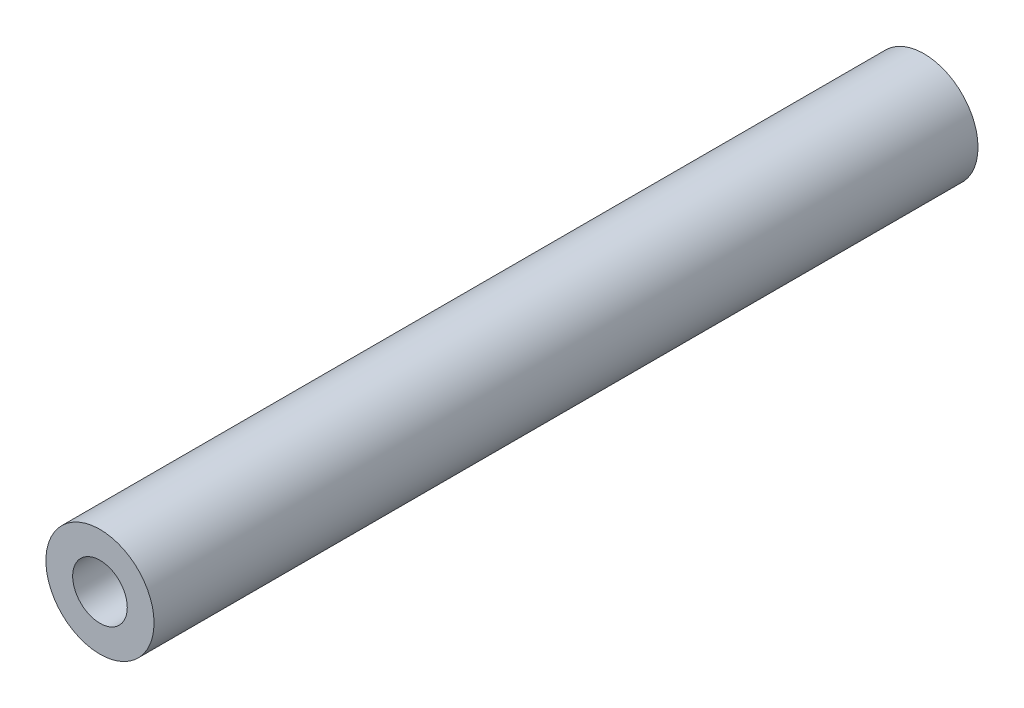
ISO-10303-21;
HEADER;
FILE_DESCRIPTION(('STEP AP214'),'2;1');
FILE_NAME('part.step','',(''),(''),'','','');
FILE_SCHEMA(('AUTOMOTIVE_DESIGN { 1 0 10303 214 1 1 1 1 }'));
ENDSEC;
DATA;
#1=APPLICATION_CONTEXT('core data for automotive mechanical design processes');
#2=APPLICATION_PROTOCOL_DEFINITION('international standard','automotive_design',2000,#1);
#3=PRODUCT_CONTEXT('',#1,'mechanical');
#4=PRODUCT('Part','Part','',(#3));
#5=PRODUCT_RELATED_PRODUCT_CATEGORY('part','',(#4));
#6=PRODUCT_DEFINITION_FORMATION('','',#4);
#7=PRODUCT_DEFINITION_CONTEXT('part definition',#1,'design');
#8=PRODUCT_DEFINITION('design','',#6,#7);
#9=PRODUCT_DEFINITION_SHAPE('','',#8);
#10=(LENGTH_UNIT() NAMED_UNIT(*) SI_UNIT(.MILLI.,.METRE.));
#11=(NAMED_UNIT(*) PLANE_ANGLE_UNIT() SI_UNIT($,.RADIAN.));
#12=(NAMED_UNIT(*) SI_UNIT($,.STERADIAN.) SOLID_ANGLE_UNIT());
#13=UNCERTAINTY_MEASURE_WITH_UNIT(LENGTH_MEASURE(1.E-05),#10,'distance_accuracy_value','');
#14=(GEOMETRIC_REPRESENTATION_CONTEXT(3) GLOBAL_UNCERTAINTY_ASSIGNED_CONTEXT((#13)) GLOBAL_UNIT_ASSIGNED_CONTEXT((#10,
#11,#12)) REPRESENTATION_CONTEXT('',''));
#15=CARTESIAN_POINT('',(0.,0.,0.));
#16=DIRECTION('',(0.,0.,1.));
#17=DIRECTION('',(1.,0.,0.));
#18=AXIS2_PLACEMENT_3D('',#15,#16,#17);
#19=CARTESIAN_POINT('',(0.,0.,76.2));
#20=DIRECTION('',(0.,0.,-1.));
#21=DIRECTION('',(-1.,0.,0.));
#22=AXIS2_PLACEMENT_3D('',#19,#20,#21);
#23=CYLINDRICAL_SURFACE('',#22,5.);
#24=CARTESIAN_POINT('',(0.,0.,76.2));
#25=DIRECTION('',(0.,0.,1.));
#26=DIRECTION('',(1.,0.,0.));
#27=AXIS2_PLACEMENT_3D('',#24,#25,#26);
#28=CIRCLE('',#27,5.);
#29=CARTESIAN_POINT('',(5.,0.,76.2));
#30=VERTEX_POINT('',#29);
#31=EDGE_CURVE('E10',#30,#30,#28,.T.);
#32=ORIENTED_EDGE('',*,*,#31,.F.);
#33=EDGE_LOOP('',(#32));
#34=FACE_BOUND('',#33,.T.);
#35=CARTESIAN_POINT('',(0.,0.,0.));
#36=DIRECTION('',(0.,0.,1.));
#37=DIRECTION('',(1.,0.,0.));
#38=AXIS2_PLACEMENT_3D('',#35,#36,#37);
#39=CIRCLE('',#38,5.);
#40=CARTESIAN_POINT('',(5.,0.,0.));
#41=VERTEX_POINT('',#40);
#42=EDGE_CURVE('E44',#41,#41,#39,.T.);
#43=ORIENTED_EDGE('',*,*,#42,.T.);
#44=EDGE_LOOP('',(#43));
#45=FACE_BOUND('',#44,.T.);
#46=ADVANCED_FACE('F41',(#34,#45),#23,.T.);
#47=CARTESIAN_POINT('',(0.,0.,76.2));
#48=DIRECTION('',(0.,0.,1.));
#49=DIRECTION('',(1.,0.,0.));
#50=AXIS2_PLACEMENT_3D('',#47,#48,#49);
#51=PLANE('',#50);
#52=CARTESIAN_POINT('',(0.,0.,76.2));
#53=DIRECTION('',(0.,0.,1.));
#54=DIRECTION('',(1.,0.,0.));
#55=AXIS2_PLACEMENT_3D('',#52,#53,#54);
#56=CIRCLE('',#55,2.525);
#57=CARTESIAN_POINT('',(2.525,0.,76.2));
#58=VERTEX_POINT('',#57);
#59=EDGE_CURVE('E55',#58,#58,#56,.T.);
#60=ORIENTED_EDGE('',*,*,#59,.F.);
#61=EDGE_LOOP('',(#60));
#62=FACE_BOUND('',#61,.T.);
#63=ORIENTED_EDGE('',*,*,#31,.T.);
#64=EDGE_LOOP('',(#63));
#65=FACE_BOUND('',#64,.T.);
#66=ADVANCED_FACE('F83',(#62,#65),#51,.T.);
#67=CARTESIAN_POINT('',(0.,0.,0.));
#68=DIRECTION('',(0.,0.,1.));
#69=DIRECTION('',(1.,0.,0.));
#70=AXIS2_PLACEMENT_3D('',#67,#68,#69);
#71=PLANE('',#70);
#72=CARTESIAN_POINT('',(0.,0.,0.));
#73=DIRECTION('',(0.,0.,1.));
#74=DIRECTION('',(1.,0.,0.));
#75=AXIS2_PLACEMENT_3D('',#72,#73,#74);
#76=CIRCLE('',#75,2.525);
#77=CARTESIAN_POINT('',(2.525,0.,0.));
#78=VERTEX_POINT('',#77);
#79=EDGE_CURVE('E63',#78,#78,#76,.T.);
#80=ORIENTED_EDGE('',*,*,#79,.T.);
#81=EDGE_LOOP('',(#80));
#82=FACE_BOUND('',#81,.T.);
#83=ORIENTED_EDGE('',*,*,#42,.F.);
#84=EDGE_LOOP('',(#83));
#85=FACE_BOUND('',#84,.T.);
#86=ADVANCED_FACE('F88',(#82,#85),#71,.F.);
#87=CARTESIAN_POINT('',(0.,0.,70.2));
#88=DIRECTION('',(0.,0.,1.));
#89=DIRECTION('',(1.,0.,0.));
#90=AXIS2_PLACEMENT_3D('',#87,#88,#89);
#91=CYLINDRICAL_SURFACE('',#90,2.525);
#92=CARTESIAN_POINT('',(0.,0.,70.2));
#93=DIRECTION('',(0.,0.,1.));
#94=DIRECTION('',(1.,0.,0.));
#95=AXIS2_PLACEMENT_3D('',#92,#93,#94);
#96=CIRCLE('',#95,2.525);
#97=CARTESIAN_POINT('',(2.525,0.,70.2));
#98=VERTEX_POINT('',#97);
#99=EDGE_CURVE('E53',#98,#98,#96,.T.);
#100=ORIENTED_EDGE('',*,*,#99,.F.);
#101=EDGE_LOOP('',(#100));
#102=FACE_BOUND('',#101,.T.);
#103=ORIENTED_EDGE('',*,*,#59,.T.);
#104=EDGE_LOOP('',(#103));
#105=FACE_BOUND('',#104,.T.);
#106=ADVANCED_FACE('F95',(#102,#105),#91,.F.);
#107=CARTESIAN_POINT('',(0.,0.,70.2));
#108=DIRECTION('',(0.,0.,1.));
#109=DIRECTION('',(1.,0.,0.));
#110=AXIS2_PLACEMENT_3D('',#107,#108,#109);
#111=PLANE('',#110);
#112=ORIENTED_EDGE('',*,*,#99,.T.);
#113=EDGE_LOOP('',(#112));
#114=FACE_BOUND('',#113,.T.);
#115=ADVANCED_FACE('F80',(#114),#111,.T.);
#116=CARTESIAN_POINT('',(0.,0.,6.));
#117=DIRECTION('',(0.,0.,-1.));
#118=DIRECTION('',(-1.,0.,0.));
#119=AXIS2_PLACEMENT_3D('',#116,#117,#118);
#120=CYLINDRICAL_SURFACE('',#119,2.525);
#121=CARTESIAN_POINT('',(0.,0.,6.));
#122=DIRECTION('',(0.,0.,1.));
#123=DIRECTION('',(1.,0.,0.));
#124=AXIS2_PLACEMENT_3D('',#121,#122,#123);
#125=CIRCLE('',#124,2.525);
#126=CARTESIAN_POINT('',(2.525,0.,6.));
#127=VERTEX_POINT('',#126);
#128=EDGE_CURVE('E59',#127,#127,#125,.T.);
#129=ORIENTED_EDGE('',*,*,#128,.T.);
#130=EDGE_LOOP('',(#129));
#131=FACE_BOUND('',#130,.T.);
#132=ORIENTED_EDGE('',*,*,#79,.F.);
#133=EDGE_LOOP('',(#132));
#134=FACE_BOUND('',#133,.T.);
#135=ADVANCED_FACE('F71',(#131,#134),#120,.F.);
#136=CARTESIAN_POINT('',(0.,0.,6.));
#137=DIRECTION('',(0.,0.,-1.));
#138=DIRECTION('',(1.,0.,0.));
#139=AXIS2_PLACEMENT_3D('',#136,#137,#138);
#140=PLANE('',#139);
#141=ORIENTED_EDGE('',*,*,#128,.F.);
#142=EDGE_LOOP('',(#141));
#143=FACE_BOUND('',#142,.T.);
#144=ADVANCED_FACE('F74',(#143),#140,.T.);
#145=CLOSED_SHELL('',(#46,#66,#86,#106,#115,#135,#144));
#146=MANIFOLD_SOLID_BREP('B2',#145);
#147=ADVANCED_BREP_SHAPE_REPRESENTATION('',(#18,#146),#14);
#148=SHAPE_DEFINITION_REPRESENTATION(#9,#147);
ENDSEC;
END-ISO-10303-21;
